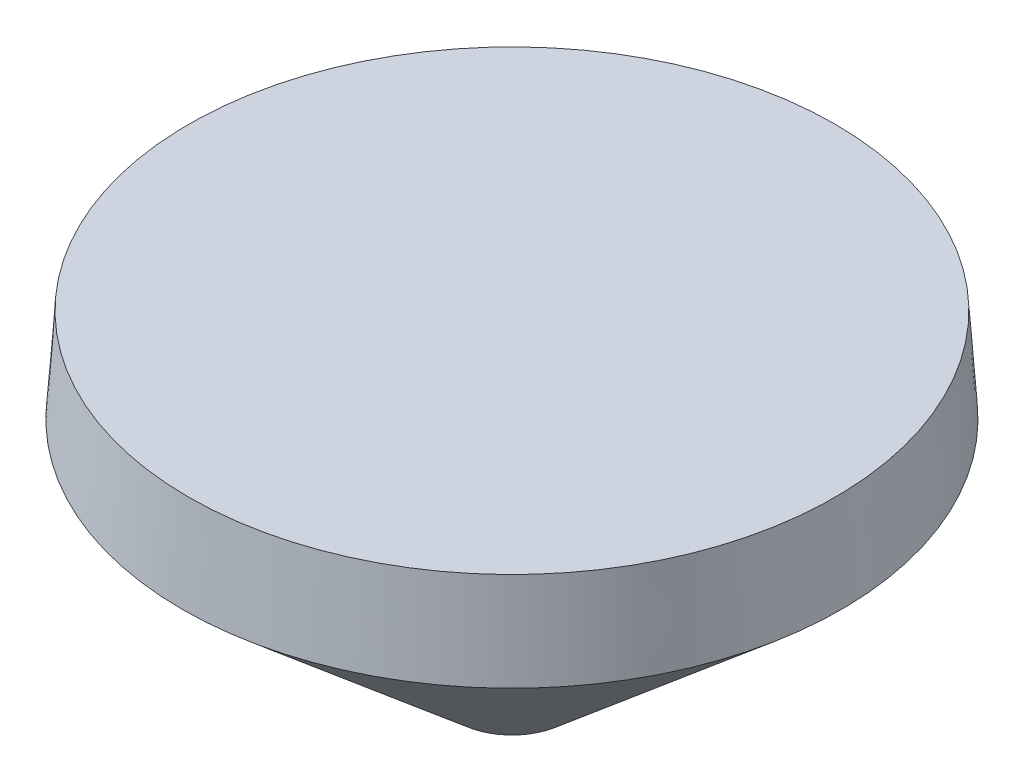
ISO-10303-21;
HEADER;
FILE_DESCRIPTION(('STEP AP214'),'2;1');
FILE_NAME('part.step','',(''),(''),'','','');
FILE_SCHEMA(('AUTOMOTIVE_DESIGN { 1 0 10303 214 1 1 1 1 }'));
ENDSEC;
DATA;
#1=APPLICATION_CONTEXT('core data for automotive mechanical design processes');
#2=APPLICATION_PROTOCOL_DEFINITION('international standard','automotive_design',2000,#1);
#3=PRODUCT_CONTEXT('',#1,'mechanical');
#4=PRODUCT('Part','Part','',(#3));
#5=PRODUCT_RELATED_PRODUCT_CATEGORY('part','',(#4));
#6=PRODUCT_DEFINITION_FORMATION('','',#4);
#7=PRODUCT_DEFINITION_CONTEXT('part definition',#1,'design');
#8=PRODUCT_DEFINITION('design','',#6,#7);
#9=PRODUCT_DEFINITION_SHAPE('','',#8);
#10=(LENGTH_UNIT() NAMED_UNIT(*) SI_UNIT(.MILLI.,.METRE.));
#11=(NAMED_UNIT(*) PLANE_ANGLE_UNIT() SI_UNIT($,.RADIAN.));
#12=(NAMED_UNIT(*) SI_UNIT($,.STERADIAN.) SOLID_ANGLE_UNIT());
#13=UNCERTAINTY_MEASURE_WITH_UNIT(LENGTH_MEASURE(1.E-05),#10,'distance_accuracy_value','');
#14=(GEOMETRIC_REPRESENTATION_CONTEXT(3) GLOBAL_UNCERTAINTY_ASSIGNED_CONTEXT((#13)) GLOBAL_UNIT_ASSIGNED_CONTEXT((#10,
#11,#12)) REPRESENTATION_CONTEXT('',''));
#15=CARTESIAN_POINT('',(0.,0.,0.));
#16=DIRECTION('',(0.,0.,1.));
#17=DIRECTION('',(1.,0.,0.));
#18=AXIS2_PLACEMENT_3D('',#15,#16,#17);
#19=CARTESIAN_POINT('',(0.,42.,0.));
#20=DIRECTION('',(0.,-1.,0.));
#21=DIRECTION('',(0.,0.,-1.));
#22=AXIS2_PLACEMENT_3D('',#19,#20,#21);
#23=PLANE('',#22);
#24=CARTESIAN_POINT('',(0.,42.,0.));
#25=DIRECTION('',(0.,1.,0.));
#26=DIRECTION('',(0.,0.,1.));
#27=AXIS2_PLACEMENT_3D('',#24,#25,#26);
#28=CIRCLE('',#27,41.275);
#29=CARTESIAN_POINT('',(0.,42.,41.275));
#30=VERTEX_POINT('',#29);
#31=EDGE_CURVE('E10',#30,#30,#28,.T.);
#32=ORIENTED_EDGE('',*,*,#31,.T.);
#33=EDGE_LOOP('',(#32));
#34=FACE_BOUND('',#33,.T.);
#35=ADVANCED_FACE('F41',(#34),#23,.F.);
#36=CARTESIAN_POINT('',(0.,30.,0.));
#37=DIRECTION('',(0.,-1.,0.));
#38=DIRECTION('',(0.,0.,-1.));
#39=AXIS2_PLACEMENT_3D('',#36,#37,#38);
#40=CONICAL_SURFACE('',#39,42.1,0.0686419890898347);
#41=ORIENTED_EDGE('',*,*,#31,.F.);
#42=EDGE_LOOP('',(#41));
#43=FACE_BOUND('',#42,.T.);
#44=CARTESIAN_POINT('',(0.,30.,0.));
#45=DIRECTION('',(0.,1.,0.));
#46=DIRECTION('',(0.,0.,1.));
#47=AXIS2_PLACEMENT_3D('',#44,#45,#46);
#48=CIRCLE('',#47,42.1);
#49=CARTESIAN_POINT('',(0.,30.,42.1));
#50=VERTEX_POINT('',#49);
#51=EDGE_CURVE('E48',#50,#50,#48,.T.);
#52=ORIENTED_EDGE('',*,*,#51,.T.);
#53=EDGE_LOOP('',(#52));
#54=FACE_BOUND('',#53,.T.);
#55=ADVANCED_FACE('F69',(#43,#54),#40,.T.);
#56=CARTESIAN_POINT('',(0.,0.,0.));
#57=DIRECTION('',(0.,1.,0.));
#58=DIRECTION('',(0.,0.,1.));
#59=AXIS2_PLACEMENT_3D('',#56,#57,#58);
#60=CONICAL_SURFACE('',#59,7.00000000000001,0.863579497003835);
#61=ORIENTED_EDGE('',*,*,#51,.F.);
#62=EDGE_LOOP('',(#61));
#63=FACE_BOUND('',#62,.T.);
#64=CARTESIAN_POINT('',(0.,0.,0.));
#65=DIRECTION('',(0.,1.,0.));
#66=DIRECTION('',(0.,0.,1.));
#67=AXIS2_PLACEMENT_3D('',#64,#65,#66);
#68=CIRCLE('',#67,7.00000000000001);
#69=CARTESIAN_POINT('',(0.,0.,7.00000000000001));
#70=VERTEX_POINT('',#69);
#71=EDGE_CURVE('E53',#70,#70,#68,.T.);
#72=ORIENTED_EDGE('',*,*,#71,.T.);
#73=EDGE_LOOP('',(#72));
#74=FACE_BOUND('',#73,.T.);
#75=ADVANCED_FACE('F61',(#63,#74),#60,.T.);
#76=CARTESIAN_POINT('',(7.00000000000001,0.,0.));
#77=DIRECTION('',(0.,1.,0.));
#78=DIRECTION('',(0.,0.,1.));
#79=AXIS2_PLACEMENT_3D('',#76,#77,#78);
#80=PLANE('',#79);
#81=ORIENTED_EDGE('',*,*,#71,.F.);
#82=EDGE_LOOP('',(#81));
#83=FACE_BOUND('',#82,.T.);
#84=ADVANCED_FACE('F63',(#83),#80,.F.);
#85=CLOSED_SHELL('',(#35,#55,#75,#84));
#86=MANIFOLD_SOLID_BREP('B2',#85);
#87=ADVANCED_BREP_SHAPE_REPRESENTATION('',(#18,#86),#14);
#88=SHAPE_DEFINITION_REPRESENTATION(#9,#87);
ENDSEC;
END-ISO-10303-21;
